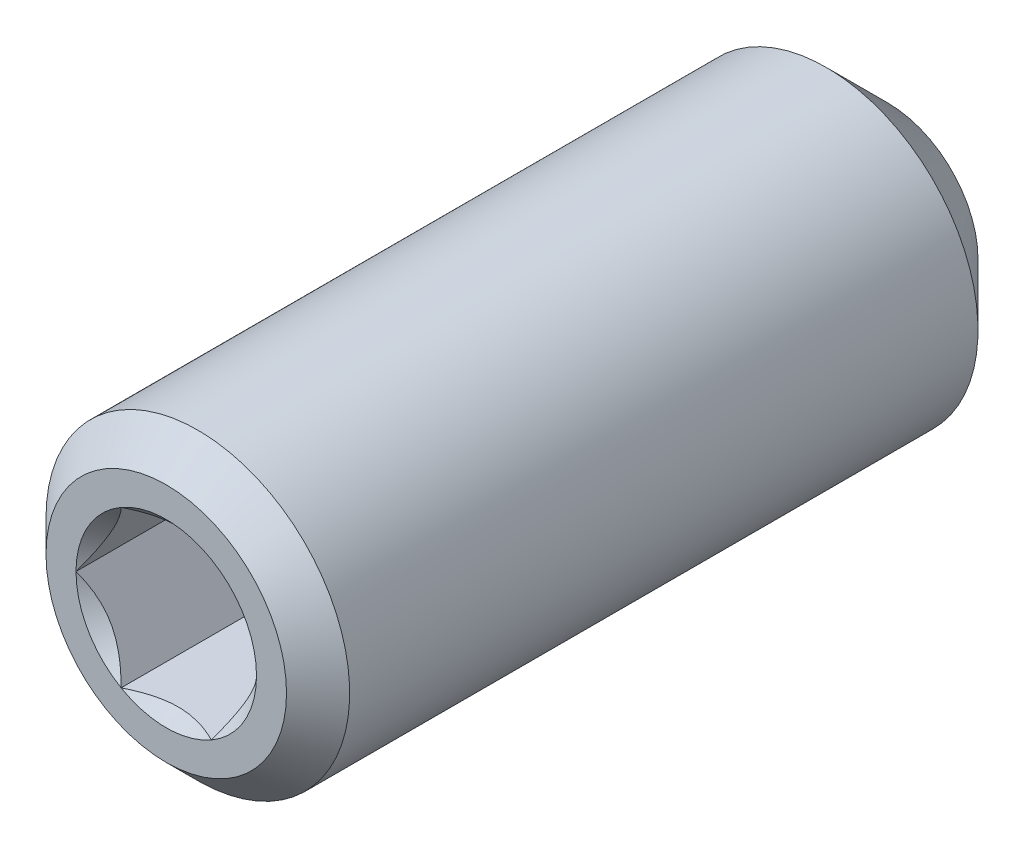
ISO-10303-21;
HEADER;
FILE_DESCRIPTION(('STEP AP214'),'2;1');
FILE_NAME('part.step','',(''),(''),'','','');
FILE_SCHEMA(('AUTOMOTIVE_DESIGN { 1 0 10303 214 1 1 1 1 }'));
ENDSEC;
DATA;
#1=APPLICATION_CONTEXT('core data for automotive mechanical design processes');
#2=APPLICATION_PROTOCOL_DEFINITION('international standard','automotive_design',2000,#1);
#3=PRODUCT_CONTEXT('',#1,'mechanical');
#4=PRODUCT('Part','Part','',(#3));
#5=PRODUCT_RELATED_PRODUCT_CATEGORY('part','',(#4));
#6=PRODUCT_DEFINITION_FORMATION('','',#4);
#7=PRODUCT_DEFINITION_CONTEXT('part definition',#1,'design');
#8=PRODUCT_DEFINITION('design','',#6,#7);
#9=PRODUCT_DEFINITION_SHAPE('','',#8);
#10=(LENGTH_UNIT() NAMED_UNIT(*) SI_UNIT(.MILLI.,.METRE.));
#11=(NAMED_UNIT(*) PLANE_ANGLE_UNIT() SI_UNIT($,.RADIAN.));
#12=(NAMED_UNIT(*) SI_UNIT($,.STERADIAN.) SOLID_ANGLE_UNIT());
#13=UNCERTAINTY_MEASURE_WITH_UNIT(LENGTH_MEASURE(1.E-05),#10,'distance_accuracy_value','');
#14=(GEOMETRIC_REPRESENTATION_CONTEXT(3) GLOBAL_UNCERTAINTY_ASSIGNED_CONTEXT((#13)) GLOBAL_UNIT_ASSIGNED_CONTEXT((#10,
#11,#12)) REPRESENTATION_CONTEXT('',''));
#15=CARTESIAN_POINT('',(0.,0.,0.));
#16=DIRECTION('',(0.,0.,1.));
#17=DIRECTION('',(1.,0.,0.));
#18=AXIS2_PLACEMENT_3D('',#15,#16,#17);
#19=CARTESIAN_POINT('',(-0.750555349947,0.,0.));
#20=DIRECTION('',(-0.866025403784329,-0.50000000000019,0.));
#21=DIRECTION('',(0.50000000000019,-0.866025403784329,0.));
#22=AXIS2_PLACEMENT_3D('',#19,#20,#21);
#23=PLANE('',#22);
#24=DIRECTION('',(0.,0.,1.));
#25=VECTOR('',#24,1.);
#26=CARTESIAN_POINT('',(-0.750555349946585,-2.39608680119296E-13,0.));
#27=LINE('',#26,#25);
#28=CARTESIAN_POINT('',(-0.750555349939481,-2.48189512564409E-13,-1.61614240464758));
#29=VERTEX_POINT('',#28);
#30=CARTESIAN_POINT('',(-0.750555349954952,3.38841107905887E-12,-5.46106603381807E-11));
#31=VERTEX_POINT('',#30);
#32=EDGE_CURVE('E85',#29,#31,#27,.T.);
#33=ORIENTED_EDGE('',*,*,#32,.T.);
#34=CARTESIAN_POINT('',(-0.375277674963107,-0.650000000018093,-5.24553175903493E-11));
#35=CARTESIAN_POINT('',(-0.388176726309613,-0.627658187716517,-0.0128852769110331));
#36=CARTESIAN_POINT('',(-0.401290579719728,-0.604944327327198,-0.0250148378954544));
#37=CARTESIAN_POINT('',(-0.428031078780609,-0.558628424334029,-0.0472236226643769));
#38=CARTESIAN_POINT('',(-0.441660266100098,-0.535021979430811,-0.0572904940137331));
#39=CARTESIAN_POINT('',(-0.469144594329594,-0.487417726525449,-0.0745327489037095));
#40=CARTESIAN_POINT('',(-0.482992712391925,-0.463432082452291,-0.0817515019675616));
#41=CARTESIAN_POINT('',(-0.510986892804127,-0.414944739662132,-0.0928821717346641));
#42=CARTESIAN_POINT('',(-0.525132117586038,-0.390444491655393,-0.0968023652147332));
#43=CARTESIAN_POINT('',(-0.559694522657562,-0.330580650039768,-0.101776897050455));
#44=CARTESIAN_POINT('',(-0.58019248275334,-0.295077141702378,-0.100873323666075));
#45=CARTESIAN_POINT('',(-0.620758505270054,-0.224814729642482,-0.0915850976183604));
#46=CARTESIAN_POINT('',(-0.640825881139145,-0.190057015062652,-0.0831892925864299));
#47=CARTESIAN_POINT('',(-0.676045362573793,-0.129055083801644,-0.0629573907277855));
#48=CARTESIAN_POINT('',(-0.691360313158306,-0.102528811273875,-0.0521824020748096));
#49=CARTESIAN_POINT('',(-0.721390903680165,-0.0505143027087447,-0.0279117157917491));
#50=CARTESIAN_POINT('',(-0.736108311763912,-0.0250230041519825,-0.014424874727794));
#51=CARTESIAN_POINT('',(-0.750555349957185,1.76412341284901E-11,-5.23779009665048E-11));
#52=B_SPLINE_CURVE_WITH_KNOTS('',3,(#34,#35,#36,#37,#38,#39,#40,#41,#42,#43,#44,#45,#46,#47,#48,
#49,#50,#51),.UNSPECIFIED.,.F.,.F.,(4,2,2,2,2,2,2,2,4),(0.,0.0865689152823221,0.173642001962946,
0.259332662444193,0.344807660426135,0.467047188368264,0.589468976886733,0.686740705162173,
0.783699770583737),.UNSPECIFIED.);
#53=CARTESIAN_POINT('',(-0.375277674978481,-0.650000000009047,-5.26027167599646E-11));
#54=VERTEX_POINT('',#53);
#55=EDGE_CURVE('E21',#54,#31,#52,.T.);
#56=ORIENTED_EDGE('',*,*,#55,.F.);
#57=DIRECTION('',(0.,0.,1.));
#58=VECTOR('',#57,1.);
#59=CARTESIAN_POINT('',(-0.375277674973,-0.65,0.));
#60=LINE('',#59,#58);
#61=CARTESIAN_POINT('',(-0.375277674976835,-0.649999999993837,-1.6161424046455));
#62=VERTEX_POINT('',#61);
#63=EDGE_CURVE('E154',#54,#62,#60,.F.);
#64=ORIENTED_EDGE('',*,*,#63,.T.);
#65=CARTESIAN_POINT('',(-0.750555349948663,-1.60702618759378E-11,-1.61614240465313));
#66=CARTESIAN_POINT('',(-0.734009567376881,-0.0286581360692253,-1.62605361911159));
#67=CARTESIAN_POINT('',(-0.71731011606058,-0.0575824342025852,-1.6350710690569));
#68=CARTESIAN_POINT('',(-0.683599170800418,-0.115971504160676,-1.65080660375776));
#69=CARTESIAN_POINT('',(-0.666586972151309,-0.145437496570717,-1.65751858360778));
#70=CARTESIAN_POINT('',(-0.632789561092063,-0.203976329690547,-1.66793300226251));
#71=CARTESIAN_POINT('',(-0.616010378963136,-0.23303872564694,-1.67171086670352));
#72=CARTESIAN_POINT('',(-0.582368823365506,-0.291307609187408,-1.67617675689356));
#73=CARTESIAN_POINT('',(-0.565506592594266,-0.320513849612226,-1.67686894246333));
#74=CARTESIAN_POINT('',(-0.534133469480445,-0.374853692837508,-1.67522540399731));
#75=CARTESIAN_POINT('',(-0.519616833477076,-0.399997243950295,-1.67329138993383));
#76=CARTESIAN_POINT('',(-0.490697507174176,-0.450086986427541,-1.66723105080883));
#77=CARTESIAN_POINT('',(-0.476294839174762,-0.475033139167064,-1.66310430695978));
#78=CARTESIAN_POINT('',(-0.447318770589634,-0.525221162160086,-1.65281205317731));
#79=CARTESIAN_POINT('',(-0.432749636471453,-0.550455642675047,-1.64659974996968));
#80=CARTESIAN_POINT('',(-0.403843431628553,-0.600522658116916,-1.63252326447357));
#81=CARTESIAN_POINT('',(-0.389505933825744,-0.625355932764774,-1.62466261783867));
#82=CARTESIAN_POINT('',(-0.375277674979914,-0.649999999988982,-1.61614240464709));
#83=B_SPLINE_CURVE_WITH_KNOTS('',3,(#65,#66,#67,#68,#69,#70,#71,#72,#73,#74,#75,#76,#77,#78,#79,
#80,#81,#82),.UNSPECIFIED.,.F.,.F.,(4,2,2,2,2,2,2,2,4),(0.,0.10367716907927,0.207626797157348,
0.308806623670867,0.409850007771033,0.497054791926755,0.584276237236673,0.673602367963236,
0.762738821277891),.UNSPECIFIED.);
#84=EDGE_CURVE('E83',#29,#62,#83,.T.);
#85=ORIENTED_EDGE('',*,*,#84,.F.);
#86=EDGE_LOOP('',(#33,#56,#64,#85));
#87=FACE_BOUND('',#86,.T.);
#88=ADVANCED_FACE('F17',(#87),#23,.F.);
#89=CARTESIAN_POINT('',(-0.375277674973,0.65,0.));
#90=DIRECTION('',(-0.866025403784329,0.50000000000019,0.));
#91=DIRECTION('',(-0.50000000000019,-0.866025403784329,0.));
#92=AXIS2_PLACEMENT_3D('',#89,#90,#91);
#93=PLANE('',#92);
#94=DIRECTION('',(0.,0.,1.));
#95=VECTOR('',#94,1.);
#96=CARTESIAN_POINT('',(-0.375277674973,0.65,0.));
#97=LINE('',#96,#95);
#98=CARTESIAN_POINT('',(-0.375277678015298,0.649999994730586,-1.61614240646535));
#99=VERTEX_POINT('',#98);
#100=CARTESIAN_POINT('',(-0.375277674974139,0.650000000008999,-5.48152481489516E-11));
#101=VERTEX_POINT('',#100);
#102=EDGE_CURVE('E108',#99,#101,#97,.T.);
#103=ORIENTED_EDGE('',*,*,#102,.T.);
#104=CARTESIAN_POINT('',(-0.750555349956909,-1.81201297615968E-11,-5.26543776156337E-11));
#105=CARTESIAN_POINT('',(-0.737656298610391,0.0223418122834764,-0.0128852769112619));
#106=CARTESIAN_POINT('',(-0.724542445200263,0.0450556726728163,-0.0250148378957129));
#107=CARTESIAN_POINT('',(-0.697801946139357,0.09137157566603,-0.0472236226646927));
#108=CARTESIAN_POINT('',(-0.684172758819854,0.114978020569271,-0.0572904940140764));
#109=CARTESIAN_POINT('',(-0.65668843059033,0.162582273474683,-0.0745327489041021));
#110=CARTESIAN_POINT('',(-0.642840312527984,0.186567917547866,-0.0817515019679759));
#111=CARTESIAN_POINT('',(-0.614846132115751,0.235055260338078,-0.0928821717351136));
#112=CARTESIAN_POINT('',(-0.600700907333825,0.259555508344844,-0.0968023652151961));
#113=CARTESIAN_POINT('',(-0.566138502262298,0.319419349960475,-0.101776897050932));
#114=CARTESIAN_POINT('',(-0.545640542166532,0.354922858297844,-0.100873323666561));
#115=CARTESIAN_POINT('',(-0.505074519649843,0.425185270357697,-0.0915850976188653));
#116=CARTESIAN_POINT('',(-0.485007143780763,0.459942984937506,-0.083189292586946));
#117=CARTESIAN_POINT('',(-0.449787662346104,0.520944916198533,-0.0629573907283045));
#118=CARTESIAN_POINT('',(-0.43447271176157,0.54747118872634,-0.0521824020753125));
#119=CARTESIAN_POINT('',(-0.404442121239669,0.599485697291543,-0.0279117157922107));
#120=CARTESIAN_POINT('',(-0.389724713155901,0.62497699584834,-0.0144248747282303));
#121=CARTESIAN_POINT('',(-0.375277674962609,0.650000000017997,-5.27870471803813E-11));
#122=B_SPLINE_CURVE_WITH_KNOTS('',3,(#104,#105,#106,#107,#108,#109,#110,#111,#112,#113,#114,
#115,#116,#117,#118,#119,#120,#121),.UNSPECIFIED.,.F.,.F.,(4,2,2,2,2,2,2,2,4),(0.,
0.0865689152824248,0.173642001963154,0.259332662444503,0.344807660426544,0.467047188368596,
0.589468976886988,0.686740705162567,0.783699770584271),.UNSPECIFIED.);
#123=EDGE_CURVE('E89',#31,#101,#122,.T.);
#124=ORIENTED_EDGE('',*,*,#123,.F.);
#125=ORIENTED_EDGE('',*,*,#32,.F.);
#126=CARTESIAN_POINT('',(-0.375277681057595,0.649999989461172,-1.61614240828725));
#127=CARTESIAN_POINT('',(-0.391823463525466,0.621341853575853,-1.62605362245236));
#128=CARTESIAN_POINT('',(-0.408522914740686,0.592417555612588,-1.63507107208264));
#129=CARTESIAN_POINT('',(-0.442233859791022,0.534028486014273,-1.65080660612539));
#130=CARTESIAN_POINT('',(-0.459246058331319,0.504562493794044,-1.65751858563274));
#131=CARTESIAN_POINT('',(-0.493043469172245,0.44602366105331,-1.66793300360798));
#132=CARTESIAN_POINT('',(-0.509822651192149,0.416961265285406,-1.67171086771072));
#133=CARTESIAN_POINT('',(-0.543464206557899,0.358692382146314,-1.67617675724721));
#134=CARTESIAN_POINT('',(-0.560326437206313,0.329486141934332,-1.67686894250143));
#135=CARTESIAN_POINT('',(-0.591699559802194,0.275146299606205,-1.67522540351505));
#136=CARTESIAN_POINT('',(-0.606216195412829,0.250002749173634,-1.67329138928411));
#137=CARTESIAN_POINT('',(-0.635135520930393,0.199913008056617,-1.66723104995963));
#138=CARTESIAN_POINT('',(-0.649538188537205,0.174966855997104,-1.66310430607864));
#139=CARTESIAN_POINT('',(-0.678514256321607,0.124778834390986,-1.65281205235699));
#140=CARTESIAN_POINT('',(-0.693083390032011,0.0995443545823152,-1.64659974924687));
#141=CARTESIAN_POINT('',(-0.721989594072825,0.049477340529697,-1.6325232640452));
#142=CARTESIAN_POINT('',(-0.736327091481276,0.0246440665648853,-1.62466261760677));
#143=CARTESIAN_POINT('',(-0.750555349939348,1.22950168124009E-11,-1.61614240464766));
#144=B_SPLINE_CURVE_WITH_KNOTS('',3,(#126,#127,#128,#129,#130,#131,#132,#133,#134,#135,#136,
#137,#138,#139,#140,#141,#142,#143),.UNSPECIFIED.,.F.,.F.,(4,2,2,2,2,2,2,2,4),(0.,
0.103677168258148,0.207626795491255,0.30880662124187,0.409850004588057,0.497054786434584,
0.584276229433694,0.673602357711447,0.762738808594383),.UNSPECIFIED.);
#145=EDGE_CURVE('E109',#99,#29,#144,.T.);
#146=ORIENTED_EDGE('',*,*,#145,.F.);
#147=EDGE_LOOP('',(#103,#124,#125,#146));
#148=FACE_BOUND('',#147,.T.);
#149=ADVANCED_FACE('F106',(#148),#93,.F.);
#150=CARTESIAN_POINT('',(-0.375277674973,-0.65,0.));
#151=DIRECTION('',(0.,-1.,0.));
#152=DIRECTION('',(1.,0.,0.));
#153=AXIS2_PLACEMENT_3D('',#150,#151,#152);
#154=PLANE('',#153);
#155=ORIENTED_EDGE('',*,*,#63,.F.);
#156=CARTESIAN_POINT('',(0.375277674993781,-0.65,-5.2786871656832E-11));
#157=CARTESIAN_POINT('',(0.349479572300786,-0.650000000000001,-0.0128852769113645));
#158=CARTESIAN_POINT('',(0.323251865480571,-0.65,-0.025014837895786));
#159=CARTESIAN_POINT('',(0.269770867358843,-0.65,-0.0472236226647092));
#160=CARTESIAN_POINT('',(0.242512492719881,-0.65,-0.057290494014066));
#161=CARTESIAN_POINT('',(0.187543836260923,-0.65,-0.0745327489040438));
#162=CARTESIAN_POINT('',(0.159847600136277,-0.65,-0.0817515019678967));
#163=CARTESIAN_POINT('',(0.103859239311905,-0.65,-0.0928821717350007));
#164=CARTESIAN_POINT('',(0.0755687897481016,-0.65,-0.0968023652150705));
#165=CARTESIAN_POINT('',(0.00644397960510634,-0.65,-0.101776897050793));
#166=CARTESIAN_POINT('',(-0.0345519405864149,-0.65,-0.100873323666415));
#167=CARTESIAN_POINT('',(-0.115683985619771,-0.65,-0.0915850976187071));
#168=CARTESIAN_POINT('',(-0.155818737357918,-0.65,-0.0831892925867819));
#169=CARTESIAN_POINT('',(-0.226257700227161,-0.65,-0.0629573907281466));
#170=CARTESIAN_POINT('',(-0.256887601396168,-0.65,-0.0521824020751729));
#171=CARTESIAN_POINT('',(-0.316948782439851,-0.65,-0.0279117157921169));
#172=CARTESIAN_POINT('',(-0.346383598607327,-0.65,-0.0144248747281639));
#173=CARTESIAN_POINT('',(-0.375277674993855,-0.65,-5.27500817907226E-11));
#174=B_SPLINE_CURVE_WITH_KNOTS('',3,(#156,#157,#158,#159,#160,#161,#162,#163,#164,#165,#166,
#167,#168,#169,#170,#171,#172,#173),.UNSPECIFIED.,.F.,.F.,(4,2,2,2,2,2,2,2,4),(0.,
0.0865689152823048,0.173642001962911,0.259332662444142,0.344807660426066,0.467047188368133,
0.589468976886541,0.68674070516196,0.783699770583503),.UNSPECIFIED.);
#175=CARTESIAN_POINT('',(0.375277674978195,-0.650000000008999,-5.27868746476451E-11));
#176=VERTEX_POINT('',#175);
#177=EDGE_CURVE('E70',#176,#54,#174,.T.);
#178=ORIENTED_EDGE('',*,*,#177,.F.);
#179=DIRECTION('',(0.,0.,1.));
#180=VECTOR('',#179,1.);
#181=CARTESIAN_POINT('',(0.375277674973,-0.65,0.));
#182=LINE('',#181,#180);
#183=CARTESIAN_POINT('',(0.37527766888494,-0.65,-1.61614240646639));
#184=VERTEX_POINT('',#183);
#185=EDGE_CURVE('E175',#176,#184,#182,.F.);
#186=ORIENTED_EDGE('',*,*,#185,.T.);
#187=CARTESIAN_POINT('',(-0.375277674958712,-0.65,-1.61614240464773));
#188=CARTESIAN_POINT('',(-0.342186109830375,-0.65,-1.62605361910872));
#189=CARTESIAN_POINT('',(-0.308787207206272,-0.65,-1.6350710690546));
#190=CARTESIAN_POINT('',(-0.24136531669771,-0.65,-1.65080660375515));
#191=CARTESIAN_POINT('',(-0.207340919402751,-0.65,-1.65751858360432));
#192=CARTESIAN_POINT('',(-0.139746097283339,-0.65,-1.6679330022602));
#193=CARTESIAN_POINT('',(-0.106187733021144,-0.65,-1.67171086670241));
#194=CARTESIAN_POINT('',(-0.0389046218159568,-0.65,-1.67617675689372));
#195=CARTESIAN_POINT('',(-0.00518016026788884,-0.65,-1.67686894246353));
#196=CARTESIAN_POINT('',(0.0575660849345219,-0.65,-1.67522540402435));
#197=CARTESIAN_POINT('',(0.0865993559129872,-0.65,-1.67329139007121));
#198=CARTESIAN_POINT('',(0.144438006483393,-0.65,-1.6672310513154));
#199=CARTESIAN_POINT('',(0.173243341475113,-0.65,-1.66310430772534));
#200=CARTESIAN_POINT('',(0.231195476604752,-0.65,-1.65281205458811));
#201=CARTESIAN_POINT('',(0.26033374380877,-0.65,-1.64659975177179));
#202=CARTESIAN_POINT('',(0.318146151469885,-0.65,-1.63252326714224));
#203=CARTESIAN_POINT('',(0.346821146083006,-0.650000000000001,-1.62466262098204));
#204=CARTESIAN_POINT('',(0.37527766279688,-0.65,-1.61614240828933));
#205=B_SPLINE_CURVE_WITH_KNOTS('',3,(#187,#188,#189,#190,#191,#192,#193,#194,#195,#196,#197,
#198,#199,#200,#201,#202,#203,#204),.UNSPECIFIED.,.F.,.F.,(4,2,2,2,2,2,2,2,4),(0.,
0.103677169067642,0.207626797132179,0.308806623660138,0.409850007776093,0.497054788841835,
0.584276231057858,0.673602358514695,0.762738808586441),.UNSPECIFIED.);
#206=EDGE_CURVE('E143',#62,#184,#205,.T.);
#207=ORIENTED_EDGE('',*,*,#206,.F.);
#208=EDGE_LOOP('',(#155,#178,#186,#207));
#209=FACE_BOUND('',#208,.T.);
#210=ADVANCED_FACE('F132',(#209),#154,.F.);
#211=CARTESIAN_POINT('',(0.,0.,-1.642731945158));
#212=DIRECTION('',(1.,0.,0.));
#213=DIRECTION('',(0.,-1.,0.));
#214=AXIS2_PLACEMENT_3D('',#211,#212,#213);
#215=SPHERICAL_SURFACE('',#214,0.375277674973);
#216=CARTESIAN_POINT('',(0.,0.,-2.00328707268227));
#217=DIRECTION('',(0.,0.,1.));
#218=DIRECTION('',(1.,0.,0.));
#219=AXIS2_PLACEMENT_3D('',#216,#217,#218);
#220=CIRCLE('',#219,0.1040833000161);
#221=CARTESIAN_POINT('',(0.1040833000161,0.,-2.00328707268227));
#222=VERTEX_POINT('',#221);
#223=EDGE_CURVE('E204',#222,#222,#220,.T.);
#224=ORIENTED_EDGE('',*,*,#223,.T.);
#225=EDGE_LOOP('',(#224));
#226=FACE_BOUND('',#225,.T.);
#227=ADVANCED_FACE('F137',(#226),#215,.F.);
#228=CARTESIAN_POINT('',(0.375277674973,0.65,0.));
#229=DIRECTION('',(0.,1.,0.));
#230=DIRECTION('',(-1.,0.,0.));
#231=AXIS2_PLACEMENT_3D('',#228,#229,#230);
#232=PLANE('',#231);
#233=DIRECTION('',(0.,0.,1.));
#234=VECTOR('',#233,1.);
#235=CARTESIAN_POINT('',(0.375277674973415,0.65000000000024,0.));
#236=LINE('',#235,#234);
#237=CARTESIAN_POINT('',(0.375277624010534,0.650000013986467,-1.61614241264933));
#238=VERTEX_POINT('',#237);
#239=CARTESIAN_POINT('',(0.37527767497792,0.650000000008075,-5.372512381416E-11));
#240=VERTEX_POINT('',#239);
#241=EDGE_CURVE('E203',#238,#240,#236,.T.);
#242=ORIENTED_EDGE('',*,*,#241,.T.);
#243=CARTESIAN_POINT('',(-0.375277674993781,0.65,-5.27869550440485E-11));
#244=CARTESIAN_POINT('',(-0.349479572300788,0.65,-0.0128852769113636));
#245=CARTESIAN_POINT('',(-0.323251865480575,0.65,-0.0250148378957842));
#246=CARTESIAN_POINT('',(-0.269770867358852,0.65,-0.0472236226647062));
#247=CARTESIAN_POINT('',(-0.242512492719892,0.65,-0.0572904940140626));
#248=CARTESIAN_POINT('',(-0.187543836260933,0.65,-0.0745327489040413));
#249=CARTESIAN_POINT('',(-0.159847600136285,0.65,-0.0817515019678949));
#250=CARTESIAN_POINT('',(-0.10385923931191,0.65,-0.0928821717350002));
#251=CARTESIAN_POINT('',(-0.075568789748104,0.65,-0.0968023652150705));
#252=CARTESIAN_POINT('',(-0.00644397960510518,0.65,-0.101776897050794));
#253=CARTESIAN_POINT('',(0.0345519405864175,0.65,-0.100873323666415));
#254=CARTESIAN_POINT('',(0.115683985619774,0.65,-0.0915850976187067));
#255=CARTESIAN_POINT('',(0.15581873735792,0.65,-0.0831892925867817));
#256=CARTESIAN_POINT('',(0.226257700226758,0.65,-0.0629573907282626));
#257=CARTESIAN_POINT('',(0.256887601395375,0.65,-0.0521824020754516));
#258=CARTESIAN_POINT('',(0.31694878243831,0.65,-0.0279117157927808));
#259=CARTESIAN_POINT('',(0.346383598605428,0.65,-0.01442487472905));
#260=CARTESIAN_POINT('',(0.37527767499161,0.65,-5.38725721333355E-11));
#261=B_SPLINE_CURVE_WITH_KNOTS('',3,(#243,#244,#245,#246,#247,#248,#249,#250,#251,#252,#253,
#254,#255,#256,#257,#258,#259,#260),.UNSPECIFIED.,.F.,.F.,(4,2,2,2,2,2,2,2,4),(0.,
0.0865689152822984,0.173642001962899,0.259332662444136,0.344807660426066,0.467047188368138,
0.589468976886541,0.686740705160702,0.783699770580996),.UNSPECIFIED.);
#262=EDGE_CURVE('E40',#101,#240,#261,.T.);
#263=ORIENTED_EDGE('',*,*,#262,.F.);
#264=ORIENTED_EDGE('',*,*,#102,.F.);
#265=CARTESIAN_POINT('',(-0.375277707261476,0.65,-1.61614239497535));
#266=CARTESIAN_POINT('',(-0.342186141635588,0.65,-1.62605361021846));
#267=CARTESIAN_POINT('',(-0.3087872385113,0.65,-1.63507106099958));
#268=CARTESIAN_POINT('',(-0.241365346950053,0.65,-1.65080659744307));
#269=CARTESIAN_POINT('',(-0.207340949102257,0.65,-1.65751857819907));
#270=CARTESIAN_POINT('',(-0.139746125822566,0.65,-1.66793299866886));
#271=CARTESIAN_POINT('',(-0.106187760954648,0.65,-1.67171086401725));
#272=CARTESIAN_POINT('',(-0.0389046484584447,0.65,-1.67617675595363));
#273=CARTESIAN_POINT('',(-0.0051801862252242,0.65,-1.67686894236281));
#274=CARTESIAN_POINT('',(0.0575660555266989,0.65,-1.67522540547016));
#275=CARTESIAN_POINT('',(0.0865993223722196,0.65,-1.67329139263001));
#276=CARTESIAN_POINT('',(0.144437964803958,0.65,-1.66723105663874));
#277=CARTESIAN_POINT('',(0.173243295790024,0.65,-1.66310431470074));
#278=CARTESIAN_POINT('',(0.231195422830998,0.65,-1.65281206530619));
#279=CARTESIAN_POINT('',(0.260333685957208,0.65,-1.6465997645984));
#280=CARTESIAN_POINT('',(0.318146085633065,0.65,-1.63252328442952));
#281=CARTESIAN_POINT('',(0.346821076338056,0.65,-1.62466264061925));
#282=CARTESIAN_POINT('',(0.375277589197696,0.65,-1.61614243032704));
#283=B_SPLINE_CURVE_WITH_KNOTS('',3,(#265,#266,#267,#268,#269,#270,#271,#272,#273,#274,#275,
#276,#277,#278,#279,#280,#281,#282),.UNSPECIFIED.,.F.,.F.,(4,2,2,2,2,2,2,2,4),(0.,
0.103677171174221,0.207626801397783,0.308806630037089,0.409850016248557,0.497054784758284,
0.584276214398926,0.673602328582849,0.762738765498276),.UNSPECIFIED.);
#284=EDGE_CURVE('E176',#99,#238,#283,.T.);
#285=ORIENTED_EDGE('',*,*,#284,.T.);
#286=EDGE_LOOP('',(#242,#263,#264,#285));
#287=FACE_BOUND('',#286,.T.);
#288=ADVANCED_FACE('F190',(#287),#232,.F.);
#289=CARTESIAN_POINT('',(0.375277674973,-0.65,0.));
#290=DIRECTION('',(0.866025403784329,-0.50000000000019,0.));
#291=DIRECTION('',(0.50000000000019,0.866025403784329,0.));
#292=AXIS2_PLACEMENT_3D('',#289,#290,#291);
#293=PLANE('',#292);
#294=ORIENTED_EDGE('',*,*,#185,.F.);
#295=CARTESIAN_POINT('',(0.750555349955763,1.61363847457604E-11,-5.37996684739661E-11));
#296=CARTESIAN_POINT('',(0.737656298609314,-0.0223418122853423,-0.0128852769122806));
#297=CARTESIAN_POINT('',(0.724542445199256,-0.0450556726745611,-0.025014837896607));
#298=CARTESIAN_POINT('',(0.697801946138497,-0.0913715756675211,-0.047223622665349));
#299=CARTESIAN_POINT('',(0.68417275881907,-0.114978020570629,-0.0572904940146197));
#300=CARTESIAN_POINT('',(0.656688430589703,-0.162582273475768,-0.0745327489044448));
#301=CARTESIAN_POINT('',(0.642840312527438,-0.186567917548812,-0.0817515019682304));
#302=CARTESIAN_POINT('',(0.614846132115372,-0.235055260338735,-0.092882171735227));
#303=CARTESIAN_POINT('',(0.600700907333531,-0.259555508345353,-0.0968023652152565));
#304=CARTESIAN_POINT('',(0.566138502262098,-0.319419349960822,-0.101776897050936));
#305=CARTESIAN_POINT('',(0.54564054216634,-0.354922858298176,-0.100873323666539));
#306=CARTESIAN_POINT('',(0.505074519649668,-0.425185270357999,-0.0915850976188029));
#307=CARTESIAN_POINT('',(0.485007143780597,-0.459942984937793,-0.0831892925868674));
#308=CARTESIAN_POINT('',(0.449787662345974,-0.520944916198758,-0.0629573907282165));
#309=CARTESIAN_POINT('',(0.434472711761467,-0.547471188726519,-0.0521824020752346));
#310=CARTESIAN_POINT('',(0.404442121239618,-0.599485697291631,-0.0279117157921643));
#311=CARTESIAN_POINT('',(0.389724713155876,-0.624976995848383,-0.0144248747282055));
#312=CARTESIAN_POINT('',(0.375277674962609,-0.650000000017998,-5.27869513222349E-11));
#313=B_SPLINE_CURVE_WITH_KNOTS('',3,(#295,#296,#297,#298,#299,#300,#301,#302,#303,#304,#305,
#306,#307,#308,#309,#310,#311,#312),.UNSPECIFIED.,.F.,.F.,(4,2,2,2,2,2,2,2,4),(0.,
0.0865689152818886,0.17364200196207,0.259332662442885,0.344807660424399,0.467047188366405,
0.589468976884756,0.686740705160176,0.783699770581713),.UNSPECIFIED.);
#314=CARTESIAN_POINT('',(0.75055534995592,2.07543517279634E-13,-5.36429495531485E-11));
#315=VERTEX_POINT('',#314);
#316=EDGE_CURVE('E168',#315,#176,#313,.T.);
#317=ORIENTED_EDGE('',*,*,#316,.F.);
#318=DIRECTION('',(0.,0.,1.));
#319=VECTOR('',#318,1.);
#320=CARTESIAN_POINT('',(0.750555349947,0.,0.));
#321=LINE('',#320,#319);
#322=CARTESIAN_POINT('',(0.750555348209446,-3.01152907814915E-09,-1.61614240568035));
#323=VERTEX_POINT('',#322);
#324=EDGE_CURVE('E291',#315,#323,#321,.F.);
#325=ORIENTED_EDGE('',*,*,#324,.T.);
#326=CARTESIAN_POINT('',(0.750555341873252,-4.35767917858742E-09,-1.61614240386835));
#327=CARTESIAN_POINT('',(0.734009562145646,-0.0286581416650857,-1.62605362008814));
#328=CARTESIAN_POINT('',(0.717310111946664,-0.0575824403987076,-1.63507107067693));
#329=CARTESIAN_POINT('',(0.683599167418591,-0.115971510948084,-1.65080660563806));
#330=CARTESIAN_POINT('',(0.666586968380525,-0.145437503347147,-1.65751858510456));
#331=CARTESIAN_POINT('',(0.632789556998878,-0.203976336539556,-1.6679330031986));
#332=CARTESIAN_POINT('',(0.616010374925866,-0.233038732574881,-1.67171086746196));
#333=CARTESIAN_POINT('',(0.58236881933833,-0.291307616225496,-1.67617675720693));
#334=CARTESIAN_POINT('',(0.565506588521352,-0.320513856681684,-1.67686894250816));
#335=CARTESIAN_POINT('',(0.534133464350137,-0.374853701708764,-1.67522540350571));
#336=CARTESIAN_POINT('',(0.519616827332166,-0.39999725458893,-1.67329138900895));
#337=CARTESIAN_POINT('',(0.490697499022503,-0.450087000549398,-1.66723104873825));
#338=CARTESIAN_POINT('',(0.476294830030937,-0.475033155004745,-1.66310430417664));
#339=CARTESIAN_POINT('',(0.447318759426709,-0.525221181492786,-1.65281204873627));
#340=CARTESIAN_POINT('',(0.432749624283041,-0.55045566378449,-1.64659974457204));
#341=CARTESIAN_POINT('',(0.403843417425538,-0.600522682716846,-1.63252325702133));
#342=CARTESIAN_POINT('',(0.389505918633523,-0.625355959078605,-1.62466260928891));
#343=CARTESIAN_POINT('',(0.37527765881174,-0.650000027992123,-1.61614239496516));
#344=B_SPLINE_CURVE_WITH_KNOTS('',3,(#326,#327,#328,#329,#330,#331,#332,#333,#334,#335,#336,
#337,#338,#339,#340,#341,#342,#343),.UNSPECIFIED.,.F.,.F.,(4,2,2,2,2,2,2,2,4),(0.,
0.103677169460282,0.207626797814286,0.30880662440973,0.409850008633122,0.497054798959713,
0.584276250445526,0.673602387783504,0.76273884768584),.UNSPECIFIED.);
#345=EDGE_CURVE('E196',#323,#184,#344,.T.);
#346=ORIENTED_EDGE('',*,*,#345,.T.);
#347=EDGE_LOOP('',(#294,#317,#325,#346));
#348=FACE_BOUND('',#347,.T.);
#349=ADVANCED_FACE('F186',(#348),#293,.F.);
#350=CARTESIAN_POINT('',(0.,0.,-1.6138195367148));
#351=DIRECTION('',(0.,0.,1.));
#352=DIRECTION('',(1.,0.,0.));
#353=AXIS2_PLACEMENT_3D('',#350,#351,#352);
#354=CONICAL_SURFACE('',#353,0.754434182113073,1.03121728661734);
#355=ORIENTED_EDGE('',*,*,#223,.F.);
#356=EDGE_LOOP('',(#355));
#357=FACE_BOUND('',#356,.T.);
#358=ORIENTED_EDGE('',*,*,#345,.F.);
#359=CARTESIAN_POINT('',(0.750555341873391,4.3579567560826E-09,-1.61614240386801));
#360=CARTESIAN_POINT('',(0.734009562146944,0.028658141663638,-1.62605362008727));
#361=CARTESIAN_POINT('',(0.717310111949056,0.0575824403954799,-1.63507107067558));
#362=CARTESIAN_POINT('',(0.683599167423274,0.115971510940975,-1.65080660563596));
#363=CARTESIAN_POINT('',(0.666586968386406,0.145437503337931,-1.65751858510222));
#364=CARTESIAN_POINT('',(0.632789557004911,0.203976336530052,-1.66793300319696));
#365=CARTESIAN_POINT('',(0.616010374930824,0.233038732567248,-1.67171086746089));
#366=CARTESIAN_POINT('',(0.582368819340934,0.291307616221946,-1.67617675720653));
#367=CARTESIAN_POINT('',(0.565506588522677,0.320513856680349,-1.67686894250785));
#368=CARTESIAN_POINT('',(0.534133464604193,0.374853701269682,-1.67522540351877));
#369=CARTESIAN_POINT('',(0.519616827839612,0.399997253710966,-1.67329138907644));
#370=CARTESIAN_POINT('',(0.490697500031517,0.450086998802692,-1.66723104898782));
#371=CARTESIAN_POINT('',(0.476294831288128,0.475033152828184,-1.66310430455392));
#372=CARTESIAN_POINT('',(0.44731876118677,0.525221178445229,-1.65281204943167));
#373=CARTESIAN_POINT('',(0.432749626297509,0.550455660296288,-1.64659974546036));
#374=CARTESIAN_POINT('',(0.403843419938964,0.600522678364424,-1.63252325833685));
#375=CARTESIAN_POINT('',(0.389505921391538,0.62535595430254,-1.62466261083845));
#376=CARTESIAN_POINT('',(0.375277661810721,0.650000022798693,-1.61614239676062));
#377=B_SPLINE_CURVE_WITH_KNOTS('',3,(#359,#360,#361,#362,#363,#364,#365,#366,#367,#368,#369,
#370,#371,#372,#373,#374,#375,#376),.UNSPECIFIED.,.F.,.F.,(4,2,2,2,2,2,2,2,4),(0.,
0.103677169453869,0.207626797800605,0.308806624402733,0.409850008633435,0.497054797437094,
0.584276247398047,0.673602383124421,0.762738841428341),.UNSPECIFIED.);
#378=EDGE_CURVE('E205',#323,#238,#377,.T.);
#379=ORIENTED_EDGE('',*,*,#378,.T.);
#380=ORIENTED_EDGE('',*,*,#284,.F.);
#381=ORIENTED_EDGE('',*,*,#145,.T.);
#382=ORIENTED_EDGE('',*,*,#84,.T.);
#383=ORIENTED_EDGE('',*,*,#206,.T.);
#384=EDGE_LOOP('',(#358,#379,#380,#381,#382,#383));
#385=FACE_BOUND('',#384,.T.);
#386=ADVANCED_FACE('F189',(#357,#385),#354,.F.);
#387=CARTESIAN_POINT('',(0.750555349947,0.,0.));
#388=DIRECTION('',(0.866025403784329,0.50000000000019,0.));
#389=DIRECTION('',(-0.50000000000019,0.866025403784329,0.));
#390=AXIS2_PLACEMENT_3D('',#387,#388,#389);
#391=PLANE('',#390);
#392=ORIENTED_EDGE('',*,*,#324,.F.);
#393=CARTESIAN_POINT('',(0.750555349946323,-1.88215280178023E-11,-4.91018161234968E-11));
#394=CARTESIAN_POINT('',(0.737656298606247,0.0223418122844159,-0.0128852769102435));
#395=CARTESIAN_POINT('',(0.724542445198922,0.0450556726741655,-0.0250148378955691));
#396=CARTESIAN_POINT('',(0.697801946140454,0.0913715756670326,-0.0472236226648636));
#397=CARTESIAN_POINT('',(0.684172758820569,0.114978020569509,-0.0572904940136846));
#398=CARTESIAN_POINT('',(0.656688430591203,0.16258227347362,-0.0745327489031126));
#399=CARTESIAN_POINT('',(0.642840312529384,0.186567917546262,-0.0817515019669474));
#400=CARTESIAN_POINT('',(0.614846132117975,0.235055260335323,-0.0928821717340923));
#401=CARTESIAN_POINT('',(0.600700907336345,0.25955550834148,-0.0968023652142172));
#402=CARTESIAN_POINT('',(0.566138502265255,0.319419349956251,-0.101776897050368));
#403=CARTESIAN_POINT('',(0.545640542169646,0.354922858293392,-0.100873323666355));
#404=CARTESIAN_POINT('',(0.505074519653189,0.425185270352875,-0.0915850976194122));
#405=CARTESIAN_POINT('',(0.485007143784185,0.459942984932542,-0.0831892925878811));
#406=CARTESIAN_POINT('',(0.449787662349328,0.520944916193904,-0.0629573907297267));
#407=CARTESIAN_POINT('',(0.434472711764535,0.547471188722161,-0.0521824020767636));
#408=CARTESIAN_POINT('',(0.404442121242147,0.59948569728821,-0.0279117157936091));
#409=CARTESIAN_POINT('',(0.389724713158153,0.624976995845402,-0.0144248747295502));
#410=CARTESIAN_POINT('',(0.375277674964642,0.650000000015434,-5.39904038671566E-11));
#411=B_SPLINE_CURVE_WITH_KNOTS('',3,(#393,#394,#395,#396,#397,#398,#399,#400,#401,#402,#403,
#404,#405,#406,#407,#408,#409,#410),.UNSPECIFIED.,.F.,.F.,(4,2,2,2,2,2,2,2,4),(0.,
0.0865689152806722,0.173642001959417,0.259332662438672,0.34480766041872,0.467047188359953,
0.589468976877624,0.686740705154636,0.783699770577668),.UNSPECIFIED.);
#412=EDGE_CURVE('E238',#315,#240,#411,.T.);
#413=ORIENTED_EDGE('',*,*,#412,.T.);
#414=ORIENTED_EDGE('',*,*,#241,.F.);
#415=ORIENTED_EDGE('',*,*,#378,.F.);
#416=EDGE_LOOP('',(#392,#413,#414,#415));
#417=FACE_BOUND('',#416,.T.);
#418=ADVANCED_FACE('F164',(#417),#391,.F.);
#419=CARTESIAN_POINT('',(0.,0.,-1.13686837721616E-10));
#420=DIRECTION('',(0.,0.,1.));
#421=DIRECTION('',(1.,0.,0.));
#422=AXIS2_PLACEMENT_3D('',#419,#420,#421);
#423=CONICAL_SURFACE('',#422,0.750555349895876,0.785398163397448);
#424=ORIENTED_EDGE('',*,*,#316,.T.);
#425=CARTESIAN_POINT('',(0.,0.,-5.6843418860808E-11));
#426=DIRECTION('',(0.,0.,1.));
#427=DIRECTION('',(1.,0.,0.));
#428=AXIS2_PLACEMENT_3D('',#425,#426,#427);
#429=CIRCLE('',#428,0.75055534995272);
#430=EDGE_CURVE('E237',#315,#176,#429,.F.);
#431=ORIENTED_EDGE('',*,*,#430,.F.);
#432=EDGE_LOOP('',(#424,#431));
#433=FACE_BOUND('',#432,.T.);
#434=ADVANCED_FACE('F159',(#433),#423,.F.);
#435=CARTESIAN_POINT('',(0.,0.,-1.13686837721616E-10));
#436=DIRECTION('',(0.,0.,1.));
#437=DIRECTION('',(1.,0.,0.));
#438=AXIS2_PLACEMENT_3D('',#435,#436,#437);
#439=CONICAL_SURFACE('',#438,0.750555349895876,0.785398163397448);
#440=ORIENTED_EDGE('',*,*,#177,.T.);
#441=CARTESIAN_POINT('',(0.,0.,-5.6843418860808E-11));
#442=DIRECTION('',(0.,0.,1.));
#443=DIRECTION('',(1.,0.,0.));
#444=AXIS2_PLACEMENT_3D('',#441,#442,#443);
#445=CIRCLE('',#444,0.75055534995272);
#446=EDGE_CURVE('E99',#176,#54,#445,.F.);
#447=ORIENTED_EDGE('',*,*,#446,.F.);
#448=EDGE_LOOP('',(#440,#447));
#449=FACE_BOUND('',#448,.T.);
#450=ADVANCED_FACE('F155',(#449),#439,.F.);
#451=CARTESIAN_POINT('',(0.,0.,-1.13686837721616E-10));
#452=DIRECTION('',(0.,0.,1.));
#453=DIRECTION('',(1.,0.,0.));
#454=AXIS2_PLACEMENT_3D('',#451,#452,#453);
#455=CONICAL_SURFACE('',#454,0.750555349895876,0.785398163397448);
#456=ORIENTED_EDGE('',*,*,#55,.T.);
#457=CARTESIAN_POINT('',(0.,0.,-5.6843418860808E-11));
#458=DIRECTION('',(0.,0.,1.));
#459=DIRECTION('',(1.,0.,0.));
#460=AXIS2_PLACEMENT_3D('',#457,#458,#459);
#461=CIRCLE('',#460,0.75055534995272);
#462=EDGE_CURVE('E79',#54,#31,#461,.F.);
#463=ORIENTED_EDGE('',*,*,#462,.F.);
#464=EDGE_LOOP('',(#456,#463));
#465=FACE_BOUND('',#464,.T.);
#466=ADVANCED_FACE('F77',(#465),#455,.F.);
#467=CARTESIAN_POINT('',(0.,0.,-1.13686837721616E-10));
#468=DIRECTION('',(0.,0.,1.));
#469=DIRECTION('',(1.,0.,0.));
#470=AXIS2_PLACEMENT_3D('',#467,#468,#469);
#471=CONICAL_SURFACE('',#470,0.750555349895876,0.785398163397448);
#472=CARTESIAN_POINT('',(0.,0.,-5.6843418860808E-11));
#473=DIRECTION('',(0.,0.,1.));
#474=DIRECTION('',(1.,0.,0.));
#475=AXIS2_PLACEMENT_3D('',#472,#473,#474);
#476=CIRCLE('',#475,0.75055534995272);
#477=EDGE_CURVE('E97',#31,#101,#476,.F.);
#478=ORIENTED_EDGE('',*,*,#477,.F.);
#479=ORIENTED_EDGE('',*,*,#123,.T.);
#480=EDGE_LOOP('',(#478,#479));
#481=FACE_BOUND('',#480,.T.);
#482=ADVANCED_FACE('F102',(#481),#471,.F.);
#483=CARTESIAN_POINT('',(0.,0.,-1.13686837721616E-10));
#484=DIRECTION('',(0.,0.,1.));
#485=DIRECTION('',(1.,0.,0.));
#486=AXIS2_PLACEMENT_3D('',#483,#484,#485);
#487=CONICAL_SURFACE('',#486,0.750555349895876,0.785398163397448);
#488=CARTESIAN_POINT('',(0.,0.,-5.6843418860808E-11));
#489=DIRECTION('',(0.,0.,1.));
#490=DIRECTION('',(1.,0.,0.));
#491=AXIS2_PLACEMENT_3D('',#488,#489,#490);
#492=CIRCLE('',#491,0.75055534995272);
#493=EDGE_CURVE('E104',#101,#240,#492,.F.);
#494=ORIENTED_EDGE('',*,*,#493,.F.);
#495=ORIENTED_EDGE('',*,*,#262,.T.);
#496=EDGE_LOOP('',(#494,#495));
#497=FACE_BOUND('',#496,.T.);
#498=ADVANCED_FACE('F250',(#497),#487,.F.);
#499=CARTESIAN_POINT('',(0.,0.,-1.13686837721616E-10));
#500=DIRECTION('',(0.,0.,1.));
#501=DIRECTION('',(1.,0.,0.));
#502=AXIS2_PLACEMENT_3D('',#499,#500,#501);
#503=CONICAL_SURFACE('',#502,0.750555349895876,0.785398163397448);
#504=CARTESIAN_POINT('',(0.,0.,-5.6843418860808E-11));
#505=DIRECTION('',(0.,0.,1.));
#506=DIRECTION('',(1.,0.,0.));
#507=AXIS2_PLACEMENT_3D('',#504,#505,#506);
#508=CIRCLE('',#507,0.75055534995272);
#509=EDGE_CURVE('E232',#240,#315,#508,.F.);
#510=ORIENTED_EDGE('',*,*,#509,.F.);
#511=ORIENTED_EDGE('',*,*,#412,.F.);
#512=EDGE_LOOP('',(#510,#511));
#513=FACE_BOUND('',#512,.T.);
#514=ADVANCED_FACE('F245',(#513),#503,.F.);
#515=CARTESIAN_POINT('',(0.,0.,-6.00000000002865));
#516=DIRECTION('',(0.,0.,-1.));
#517=DIRECTION('',(-1.,0.,0.));
#518=AXIS2_PLACEMENT_3D('',#515,#516,#517);
#519=CONICAL_SURFACE('',#518,0.749999999982265,1.04719755107997);
#520=CARTESIAN_POINT('',(0.,0.,-5.99999999997181));
#521=DIRECTION('',(0.,0.,1.));
#522=DIRECTION('',(1.,0.,0.));
#523=AXIS2_PLACEMENT_3D('',#520,#521,#522);
#524=CIRCLE('',#523,0.749999999982265);
#525=CARTESIAN_POINT('',(0.749999999982265,0.,-5.99999999997181));
#526=VERTEX_POINT('',#525);
#527=EDGE_CURVE('E231',#526,#526,#524,.T.);
#528=ORIENTED_EDGE('',*,*,#527,.F.);
#529=EDGE_LOOP('',(#528));
#530=FACE_BOUND('',#529,.T.);
#531=CARTESIAN_POINT('',(-1.13686837721616E-10,0.,-5.56698729809568));
#532=VERTEX_POINT('',#531);
#533=VERTEX_LOOP('',#532);
#534=FACE_BOUND('',#533,.T.);
#535=ADVANCED_FACE('F249',(#530,#534),#519,.F.);
#536=CARTESIAN_POINT('',(0.,0.,0.));
#537=DIRECTION('',(0.,0.,1.));
#538=DIRECTION('',(1.,0.,0.));
#539=AXIS2_PLACEMENT_3D('',#536,#537,#538);
#540=PLANE('',#539);
#541=ORIENTED_EDGE('',*,*,#493,.T.);
#542=ORIENTED_EDGE('',*,*,#509,.T.);
#543=ORIENTED_EDGE('',*,*,#430,.T.);
#544=ORIENTED_EDGE('',*,*,#446,.T.);
#545=ORIENTED_EDGE('',*,*,#462,.T.);
#546=ORIENTED_EDGE('',*,*,#477,.T.);
#547=EDGE_LOOP('',(#541,#542,#543,#544,#545,#546));
#548=FACE_BOUND('',#547,.T.);
#549=CARTESIAN_POINT('',(0.,0.,0.));
#550=DIRECTION('',(0.,0.,-1.));
#551=DIRECTION('',(-1.,0.,0.));
#552=AXIS2_PLACEMENT_3D('',#549,#550,#551);
#553=CIRCLE('',#552,0.999999999976353);
#554=CARTESIAN_POINT('',(-0.999999999976353,0.,0.));
#555=VERTEX_POINT('',#554);
#556=EDGE_CURVE('E228',#555,#555,#553,.T.);
#557=ORIENTED_EDGE('',*,*,#556,.F.);
#558=EDGE_LOOP('',(#557));
#559=FACE_BOUND('',#558,.T.);
#560=ADVANCED_FACE('F95',(#548,#559),#540,.T.);
#561=CARTESIAN_POINT('',(0.,0.,-5.48750000001519));
#562=DIRECTION('',(0.,0.,1.));
#563=DIRECTION('',(1.,0.,0.));
#564=AXIS2_PLACEMENT_3D('',#561,#562,#563);
#565=CONICAL_SURFACE('',#564,1.26249999993888,0.785398163397448);
#566=ORIENTED_EDGE('',*,*,#527,.T.);
#567=EDGE_LOOP('',(#566));
#568=FACE_BOUND('',#567,.T.);
#569=CARTESIAN_POINT('',(0.,0.,-5.4875));
#570=DIRECTION('',(0.,0.,-1.));
#571=DIRECTION('',(-1.,0.,0.));
#572=AXIS2_PLACEMENT_3D('',#569,#570,#571);
#573=CIRCLE('',#572,1.2625);
#574=CARTESIAN_POINT('',(-1.2625,0.,-5.4875));
#575=VERTEX_POINT('',#574);
#576=EDGE_CURVE('E32',#575,#575,#573,.F.);
#577=ORIENTED_EDGE('',*,*,#576,.F.);
#578=EDGE_LOOP('',(#577));
#579=FACE_BOUND('',#578,.T.);
#580=ADVANCED_FACE('F267',(#568,#579),#565,.T.);
#581=CARTESIAN_POINT('',(0.,0.,-0.262500000019372));
#582=DIRECTION('',(0.,0.,-1.));
#583=DIRECTION('',(-1.,0.,0.));
#584=AXIS2_PLACEMENT_3D('',#581,#582,#583);
#585=CONICAL_SURFACE('',#584,1.26250000005257,0.785398163505721);
#586=CARTESIAN_POINT('',(0.,0.,-0.2625));
#587=DIRECTION('',(0.,0.,-1.));
#588=DIRECTION('',(-1.,0.,0.));
#589=AXIS2_PLACEMENT_3D('',#586,#587,#588);
#590=CIRCLE('',#589,1.2625);
#591=CARTESIAN_POINT('',(-1.2625,0.,-0.2625));
#592=VERTEX_POINT('',#591);
#593=EDGE_CURVE('E11',#592,#592,#590,.T.);
#594=ORIENTED_EDGE('',*,*,#593,.F.);
#595=EDGE_LOOP('',(#594));
#596=FACE_BOUND('',#595,.T.);
#597=ORIENTED_EDGE('',*,*,#556,.T.);
#598=EDGE_LOOP('',(#597));
#599=FACE_BOUND('',#598,.T.);
#600=ADVANCED_FACE('F261',(#596,#599),#585,.T.);
#601=CARTESIAN_POINT('',(0.,0.,-0.2625));
#602=DIRECTION('',(0.,0.,-1.));
#603=DIRECTION('',(-1.,0.,0.));
#604=AXIS2_PLACEMENT_3D('',#601,#602,#603);
#605=CYLINDRICAL_SURFACE('',#604,1.2625);
#606=ORIENTED_EDGE('',*,*,#576,.T.);
#607=EDGE_LOOP('',(#606));
#608=FACE_BOUND('',#607,.T.);
#609=ORIENTED_EDGE('',*,*,#593,.T.);
#610=EDGE_LOOP('',(#609));
#611=FACE_BOUND('',#610,.T.);
#612=ADVANCED_FACE('F259',(#608,#611),#605,.T.);
#613=CLOSED_SHELL('',(#88,#149,#210,#227,#288,#349,#386,#418,#434,#450,#466,#482,#498,#514,#535,
#560,#580,#600,#612));
#614=MANIFOLD_SOLID_BREP('B1',#613);
#615=ADVANCED_BREP_SHAPE_REPRESENTATION('',(#18,#614),#14);
#616=SHAPE_DEFINITION_REPRESENTATION(#9,#615);
ENDSEC;
END-ISO-10303-21;
